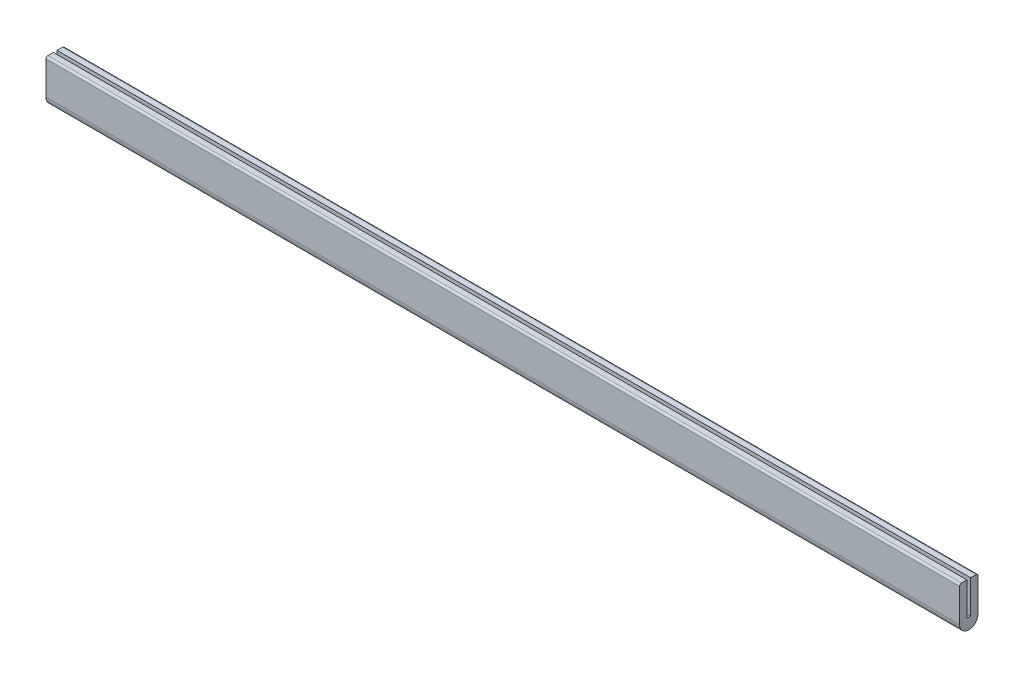
ISO-10303-21;
HEADER;
FILE_DESCRIPTION(('STEP AP214'),'2;1');
FILE_NAME('part.step','',(''),(''),'','','');
FILE_SCHEMA(('AUTOMOTIVE_DESIGN { 1 0 10303 214 1 1 1 1 }'));
ENDSEC;
DATA;
#1=APPLICATION_CONTEXT('core data for automotive mechanical design processes');
#2=APPLICATION_PROTOCOL_DEFINITION('international standard','automotive_design',2000,#1);
#3=PRODUCT_CONTEXT('',#1,'mechanical');
#4=PRODUCT('Part','Part','',(#3));
#5=PRODUCT_RELATED_PRODUCT_CATEGORY('part','',(#4));
#6=PRODUCT_DEFINITION_FORMATION('','',#4);
#7=PRODUCT_DEFINITION_CONTEXT('part definition',#1,'design');
#8=PRODUCT_DEFINITION('design','',#6,#7);
#9=PRODUCT_DEFINITION_SHAPE('','',#8);
#10=(LENGTH_UNIT() NAMED_UNIT(*) SI_UNIT(.MILLI.,.METRE.));
#11=(NAMED_UNIT(*) PLANE_ANGLE_UNIT() SI_UNIT($,.RADIAN.));
#12=(NAMED_UNIT(*) SI_UNIT($,.STERADIAN.) SOLID_ANGLE_UNIT());
#13=UNCERTAINTY_MEASURE_WITH_UNIT(LENGTH_MEASURE(1.E-05),#10,'distance_accuracy_value','');
#14=(GEOMETRIC_REPRESENTATION_CONTEXT(3) GLOBAL_UNCERTAINTY_ASSIGNED_CONTEXT((#13)) GLOBAL_UNIT_ASSIGNED_CONTEXT((#10,
#11,#12)) REPRESENTATION_CONTEXT('',''));
#15=CARTESIAN_POINT('',(0.,0.,0.));
#16=DIRECTION('',(0.,0.,1.));
#17=DIRECTION('',(1.,0.,0.));
#18=AXIS2_PLACEMENT_3D('',#15,#16,#17);
#19=CARTESIAN_POINT('',(393.7,28.575,1.5875));
#20=DIRECTION('',(0.,0.,1.));
#21=DIRECTION('',(0.,-1.,0.));
#22=AXIS2_PLACEMENT_3D('',#19,#20,#21);
#23=PLANE('',#22);
#24=DIRECTION('',(0.,1.,0.));
#25=VECTOR('',#24,1.);
#26=CARTESIAN_POINT('',(-393.7,28.575,1.5875));
#27=LINE('',#26,#25);
#28=CARTESIAN_POINT('',(-393.7,0.,1.5875));
#29=VERTEX_POINT('',#28);
#30=CARTESIAN_POINT('',(-393.7,28.575,1.5875));
#31=VERTEX_POINT('',#30);
#32=EDGE_CURVE('E161',#29,#31,#27,.T.);
#33=ORIENTED_EDGE('',*,*,#32,.T.);
#34=DIRECTION('',(-1.,0.,0.));
#35=VECTOR('',#34,1.);
#36=CARTESIAN_POINT('',(393.7,28.575,1.5875));
#37=LINE('',#36,#35);
#38=CARTESIAN_POINT('',(393.7,28.575,1.5875));
#39=VERTEX_POINT('',#38);
#40=EDGE_CURVE('E141',#39,#31,#37,.T.);
#41=ORIENTED_EDGE('',*,*,#40,.F.);
#42=DIRECTION('',(0.,1.,0.));
#43=VECTOR('',#42,1.);
#44=CARTESIAN_POINT('',(393.7,28.575,1.5875));
#45=LINE('',#44,#43);
#46=CARTESIAN_POINT('',(393.7,0.,1.5875));
#47=VERTEX_POINT('',#46);
#48=EDGE_CURVE('E148',#47,#39,#45,.T.);
#49=ORIENTED_EDGE('',*,*,#48,.F.);
#50=DIRECTION('',(-1.,0.,0.));
#51=VECTOR('',#50,1.);
#52=CARTESIAN_POINT('',(393.7,0.,1.5875));
#53=LINE('',#52,#51);
#54=EDGE_CURVE('E219',#47,#29,#53,.T.);
#55=ORIENTED_EDGE('',*,*,#54,.T.);
#56=EDGE_LOOP('',(#33,#41,#49,#55));
#57=FACE_BOUND('',#56,.T.);
#58=ADVANCED_FACE('F38',(#57),#23,.F.);
#59=CARTESIAN_POINT('',(393.7,28.575,1.5875));
#60=DIRECTION('',(0.,-1.,0.));
#61=DIRECTION('',(0.,0.,-1.));
#62=AXIS2_PLACEMENT_3D('',#59,#60,#61);
#63=PLANE('',#62);
#64=DIRECTION('',(0.,0.,1.));
#65=VECTOR('',#64,1.);
#66=CARTESIAN_POINT('',(-393.7,28.575,1.5875));
#67=LINE('',#66,#65);
#68=CARTESIAN_POINT('',(-393.7,28.575,6.34999999999999));
#69=VERTEX_POINT('',#68);
#70=EDGE_CURVE('E237',#31,#69,#67,.T.);
#71=ORIENTED_EDGE('',*,*,#70,.T.);
#72=DIRECTION('',(-1.,0.,0.));
#73=VECTOR('',#72,1.);
#74=CARTESIAN_POINT('',(393.7,28.575,6.34999999999999));
#75=LINE('',#74,#73);
#76=CARTESIAN_POINT('',(393.7,28.575,6.34999999999999));
#77=VERTEX_POINT('',#76);
#78=EDGE_CURVE('E144',#69,#77,#75,.F.);
#79=ORIENTED_EDGE('',*,*,#78,.T.);
#80=DIRECTION('',(0.,0.,1.));
#81=VECTOR('',#80,1.);
#82=CARTESIAN_POINT('',(393.7,28.575,1.5875));
#83=LINE('',#82,#81);
#84=EDGE_CURVE('E136',#39,#77,#83,.T.);
#85=ORIENTED_EDGE('',*,*,#84,.F.);
#86=ORIENTED_EDGE('',*,*,#40,.T.);
#87=EDGE_LOOP('',(#71,#79,#85,#86));
#88=FACE_BOUND('',#87,.T.);
#89=ADVANCED_FACE('F139',(#88),#63,.F.);
#90=CARTESIAN_POINT('',(393.7,28.575,7.93749999999999));
#91=DIRECTION('',(0.,0.,-1.));
#92=DIRECTION('',(0.,1.,0.));
#93=AXIS2_PLACEMENT_3D('',#90,#91,#92);
#94=PLANE('',#93);
#95=DIRECTION('',(0.,-1.,0.));
#96=VECTOR('',#95,1.);
#97=CARTESIAN_POINT('',(393.7,28.575,7.93749999999999));
#98=LINE('',#97,#96);
#99=CARTESIAN_POINT('',(393.7,26.9875,7.93749999999999));
#100=VERTEX_POINT('',#99);
#101=CARTESIAN_POINT('',(393.7,-1.58750000000001,7.9375));
#102=VERTEX_POINT('',#101);
#103=EDGE_CURVE('E147',#100,#102,#98,.T.);
#104=ORIENTED_EDGE('',*,*,#103,.F.);
#105=DIRECTION('',(-1.,0.,0.));
#106=VECTOR('',#105,1.);
#107=CARTESIAN_POINT('',(393.7,26.9875,7.93749999999999));
#108=LINE('',#107,#106);
#109=CARTESIAN_POINT('',(-393.7,26.9875,7.93749999999999));
#110=VERTEX_POINT('',#109);
#111=EDGE_CURVE('E163',#100,#110,#108,.T.);
#112=ORIENTED_EDGE('',*,*,#111,.T.);
#113=DIRECTION('',(0.,-1.,0.));
#114=VECTOR('',#113,1.);
#115=CARTESIAN_POINT('',(-393.7,28.575,7.93749999999999));
#116=LINE('',#115,#114);
#117=CARTESIAN_POINT('',(-393.7,-1.58750000000001,7.9375));
#118=VERTEX_POINT('',#117);
#119=EDGE_CURVE('E235',#110,#118,#116,.T.);
#120=ORIENTED_EDGE('',*,*,#119,.T.);
#121=DIRECTION('',(-1.,0.,0.));
#122=VECTOR('',#121,1.);
#123=CARTESIAN_POINT('',(393.7,-1.58750000000001,7.9375));
#124=LINE('',#123,#122);
#125=EDGE_CURVE('E164',#102,#118,#124,.T.);
#126=ORIENTED_EDGE('',*,*,#125,.F.);
#127=EDGE_LOOP('',(#104,#112,#120,#126));
#128=FACE_BOUND('',#127,.T.);
#129=ADVANCED_FACE('F261',(#128),#94,.F.);
#130=CARTESIAN_POINT('',(393.7,-1.58750000000001,0.));
#131=DIRECTION('',(-1.,0.,0.));
#132=DIRECTION('',(0.,0.,1.));
#133=AXIS2_PLACEMENT_3D('',#130,#131,#132);
#134=CYLINDRICAL_SURFACE('',#133,7.9375);
#135=CARTESIAN_POINT('',(-393.7,-1.58750000000001,0.));
#136=DIRECTION('',(1.,0.,0.));
#137=DIRECTION('',(0.,0.,1.));
#138=AXIS2_PLACEMENT_3D('',#135,#136,#137);
#139=CIRCLE('',#138,7.9375);
#140=CARTESIAN_POINT('',(-393.7,-1.5875,-7.9375));
#141=VERTEX_POINT('',#140);
#142=EDGE_CURVE('E213',#118,#141,#139,.T.);
#143=ORIENTED_EDGE('',*,*,#142,.T.);
#144=DIRECTION('',(-1.,0.,0.));
#145=VECTOR('',#144,1.);
#146=CARTESIAN_POINT('',(393.7,-1.5875,-7.9375));
#147=LINE('',#146,#145);
#148=CARTESIAN_POINT('',(393.7,-1.5875,-7.9375));
#149=VERTEX_POINT('',#148);
#150=EDGE_CURVE('E174',#149,#141,#147,.T.);
#151=ORIENTED_EDGE('',*,*,#150,.F.);
#152=CARTESIAN_POINT('',(393.7,-1.58750000000001,0.));
#153=DIRECTION('',(1.,0.,0.));
#154=DIRECTION('',(0.,0.,1.));
#155=AXIS2_PLACEMENT_3D('',#152,#153,#154);
#156=CIRCLE('',#155,7.9375);
#157=EDGE_CURVE('E253',#102,#149,#156,.T.);
#158=ORIENTED_EDGE('',*,*,#157,.F.);
#159=ORIENTED_EDGE('',*,*,#125,.T.);
#160=EDGE_LOOP('',(#143,#151,#158,#159));
#161=FACE_BOUND('',#160,.T.);
#162=ADVANCED_FACE('F262',(#161),#134,.T.);
#163=CARTESIAN_POINT('',(393.7,28.575,-7.93749999999999));
#164=DIRECTION('',(0.,0.,1.));
#165=DIRECTION('',(0.,-1.,0.));
#166=AXIS2_PLACEMENT_3D('',#163,#164,#165);
#167=PLANE('',#166);
#168=DIRECTION('',(0.,1.,0.));
#169=VECTOR('',#168,1.);
#170=CARTESIAN_POINT('',(-393.7,28.575,-7.93749999999999));
#171=LINE('',#170,#169);
#172=CARTESIAN_POINT('',(-393.7,26.9875,-7.93749999999999));
#173=VERTEX_POINT('',#172);
#174=EDGE_CURVE('E208',#141,#173,#171,.T.);
#175=ORIENTED_EDGE('',*,*,#174,.T.);
#176=DIRECTION('',(-1.,0.,0.));
#177=VECTOR('',#176,1.);
#178=CARTESIAN_POINT('',(393.7,26.9875,-7.93749999999999));
#179=LINE('',#178,#177);
#180=CARTESIAN_POINT('',(393.7,26.9875,-7.93749999999999));
#181=VERTEX_POINT('',#180);
#182=EDGE_CURVE('E11',#173,#181,#179,.F.);
#183=ORIENTED_EDGE('',*,*,#182,.T.);
#184=DIRECTION('',(0.,1.,0.));
#185=VECTOR('',#184,1.);
#186=CARTESIAN_POINT('',(393.7,28.575,-7.93749999999999));
#187=LINE('',#186,#185);
#188=EDGE_CURVE('E231',#149,#181,#187,.T.);
#189=ORIENTED_EDGE('',*,*,#188,.F.);
#190=ORIENTED_EDGE('',*,*,#150,.T.);
#191=EDGE_LOOP('',(#175,#183,#189,#190));
#192=FACE_BOUND('',#191,.T.);
#193=ADVANCED_FACE('F230',(#192),#167,.F.);
#194=CARTESIAN_POINT('',(393.7,28.575,-7.93749999999999));
#195=DIRECTION('',(0.,-1.,0.));
#196=DIRECTION('',(0.,0.,-1.));
#197=AXIS2_PLACEMENT_3D('',#194,#195,#196);
#198=PLANE('',#197);
#199=DIRECTION('',(0.,0.,1.));
#200=VECTOR('',#199,1.);
#201=CARTESIAN_POINT('',(393.7,28.575,-7.93749999999999));
#202=LINE('',#201,#200);
#203=CARTESIAN_POINT('',(393.7,28.575,-6.34999999999999));
#204=VERTEX_POINT('',#203);
#205=CARTESIAN_POINT('',(393.7,28.575,-1.58749999999999));
#206=VERTEX_POINT('',#205);
#207=EDGE_CURVE('E198',#204,#206,#202,.T.);
#208=ORIENTED_EDGE('',*,*,#207,.F.);
#209=DIRECTION('',(-1.,0.,0.));
#210=VECTOR('',#209,1.);
#211=CARTESIAN_POINT('',(393.7,28.575,-6.34999999999999));
#212=LINE('',#211,#210);
#213=CARTESIAN_POINT('',(-393.7,28.575,-6.34999999999999));
#214=VERTEX_POINT('',#213);
#215=EDGE_CURVE('E47',#204,#214,#212,.T.);
#216=ORIENTED_EDGE('',*,*,#215,.T.);
#217=DIRECTION('',(0.,0.,1.));
#218=VECTOR('',#217,1.);
#219=CARTESIAN_POINT('',(-393.7,28.575,-7.93749999999999));
#220=LINE('',#219,#218);
#221=CARTESIAN_POINT('',(-393.7,28.575,-1.58749999999999));
#222=VERTEX_POINT('',#221);
#223=EDGE_CURVE('E196',#214,#222,#220,.T.);
#224=ORIENTED_EDGE('',*,*,#223,.T.);
#225=DIRECTION('',(-1.,0.,0.));
#226=VECTOR('',#225,1.);
#227=CARTESIAN_POINT('',(393.7,28.575,-1.58749999999999));
#228=LINE('',#227,#226);
#229=EDGE_CURVE('E226',#206,#222,#228,.T.);
#230=ORIENTED_EDGE('',*,*,#229,.F.);
#231=EDGE_LOOP('',(#208,#216,#224,#230));
#232=FACE_BOUND('',#231,.T.);
#233=ADVANCED_FACE('F194',(#232),#198,.F.);
#234=CARTESIAN_POINT('',(393.7,28.575,-1.58749999999999));
#235=DIRECTION('',(0.,0.,-1.));
#236=DIRECTION('',(0.,1.,0.));
#237=AXIS2_PLACEMENT_3D('',#234,#235,#236);
#238=PLANE('',#237);
#239=DIRECTION('',(0.,-1.,0.));
#240=VECTOR('',#239,1.);
#241=CARTESIAN_POINT('',(-393.7,28.575,-1.58749999999999));
#242=LINE('',#241,#240);
#243=CARTESIAN_POINT('',(-393.7,0.,-1.5875));
#244=VERTEX_POINT('',#243);
#245=EDGE_CURVE('E206',#222,#244,#242,.T.);
#246=ORIENTED_EDGE('',*,*,#245,.T.);
#247=DIRECTION('',(-1.,0.,0.));
#248=VECTOR('',#247,1.);
#249=CARTESIAN_POINT('',(393.7,0.,-1.5875));
#250=LINE('',#249,#248);
#251=CARTESIAN_POINT('',(393.7,0.,-1.5875));
#252=VERTEX_POINT('',#251);
#253=EDGE_CURVE('E222',#252,#244,#250,.T.);
#254=ORIENTED_EDGE('',*,*,#253,.F.);
#255=DIRECTION('',(0.,-1.,0.));
#256=VECTOR('',#255,1.);
#257=CARTESIAN_POINT('',(393.7,28.575,-1.58749999999999));
#258=LINE('',#257,#256);
#259=EDGE_CURVE('E246',#206,#252,#258,.T.);
#260=ORIENTED_EDGE('',*,*,#259,.F.);
#261=ORIENTED_EDGE('',*,*,#229,.T.);
#262=EDGE_LOOP('',(#246,#254,#260,#261));
#263=FACE_BOUND('',#262,.T.);
#264=ADVANCED_FACE('F290',(#263),#238,.F.);
#265=CARTESIAN_POINT('',(393.7,0.,1.5875));
#266=DIRECTION('',(0.,-1.,0.));
#267=DIRECTION('',(0.,0.,-1.));
#268=AXIS2_PLACEMENT_3D('',#265,#266,#267);
#269=PLANE('',#268);
#270=DIRECTION('',(0.,0.,1.));
#271=VECTOR('',#270,1.);
#272=CARTESIAN_POINT('',(-393.7,0.,1.5875));
#273=LINE('',#272,#271);
#274=EDGE_CURVE('E158',#244,#29,#273,.T.);
#275=ORIENTED_EDGE('',*,*,#274,.T.);
#276=ORIENTED_EDGE('',*,*,#54,.F.);
#277=DIRECTION('',(0.,0.,1.));
#278=VECTOR('',#277,1.);
#279=CARTESIAN_POINT('',(393.7,0.,1.5875));
#280=LINE('',#279,#278);
#281=EDGE_CURVE('E153',#252,#47,#280,.T.);
#282=ORIENTED_EDGE('',*,*,#281,.F.);
#283=ORIENTED_EDGE('',*,*,#253,.T.);
#284=EDGE_LOOP('',(#275,#276,#282,#283));
#285=FACE_BOUND('',#284,.T.);
#286=ADVANCED_FACE('F286',(#285),#269,.F.);
#287=CARTESIAN_POINT('',(393.7,-1.58750000000001,0.));
#288=DIRECTION('',(-1.,0.,0.));
#289=DIRECTION('',(0.,0.,1.));
#290=AXIS2_PLACEMENT_3D('',#287,#288,#289);
#291=PLANE('',#290);
#292=ORIENTED_EDGE('',*,*,#84,.T.);
#293=CARTESIAN_POINT('',(393.7,26.9875,6.34999999999999));
#294=DIRECTION('',(-1.,0.,0.));
#295=DIRECTION('',(0.,0.,1.));
#296=AXIS2_PLACEMENT_3D('',#293,#294,#295);
#297=CIRCLE('',#296,1.5875);
#298=EDGE_CURVE('E186',#77,#100,#297,.F.);
#299=ORIENTED_EDGE('',*,*,#298,.T.);
#300=ORIENTED_EDGE('',*,*,#103,.T.);
#301=ORIENTED_EDGE('',*,*,#157,.T.);
#302=ORIENTED_EDGE('',*,*,#188,.T.);
#303=CARTESIAN_POINT('',(393.7,26.9875,-6.34999999999999));
#304=DIRECTION('',(-1.,0.,0.));
#305=DIRECTION('',(0.,0.,1.));
#306=AXIS2_PLACEMENT_3D('',#303,#304,#305);
#307=CIRCLE('',#306,1.5875);
#308=EDGE_CURVE('E57',#181,#204,#307,.F.);
#309=ORIENTED_EDGE('',*,*,#308,.T.);
#310=ORIENTED_EDGE('',*,*,#207,.T.);
#311=ORIENTED_EDGE('',*,*,#259,.T.);
#312=ORIENTED_EDGE('',*,*,#281,.T.);
#313=ORIENTED_EDGE('',*,*,#48,.T.);
#314=EDGE_LOOP('',(#292,#299,#300,#301,#302,#309,#310,#311,#312,#313));
#315=FACE_BOUND('',#314,.T.);
#316=ADVANCED_FACE('F151',(#315),#291,.F.);
#317=CARTESIAN_POINT('',(-393.7,-1.58750000000001,0.));
#318=DIRECTION('',(-1.,0.,0.));
#319=DIRECTION('',(0.,0.,1.));
#320=AXIS2_PLACEMENT_3D('',#317,#318,#319);
#321=PLANE('',#320);
#322=ORIENTED_EDGE('',*,*,#119,.F.);
#323=CARTESIAN_POINT('',(-393.7,26.9875,6.34999999999999));
#324=DIRECTION('',(-1.,0.,0.));
#325=DIRECTION('',(0.,0.,1.));
#326=AXIS2_PLACEMENT_3D('',#323,#324,#325);
#327=CIRCLE('',#326,1.5875);
#328=EDGE_CURVE('E180',#110,#69,#327,.T.);
#329=ORIENTED_EDGE('',*,*,#328,.T.);
#330=ORIENTED_EDGE('',*,*,#70,.F.);
#331=ORIENTED_EDGE('',*,*,#32,.F.);
#332=ORIENTED_EDGE('',*,*,#274,.F.);
#333=ORIENTED_EDGE('',*,*,#245,.F.);
#334=ORIENTED_EDGE('',*,*,#223,.F.);
#335=CARTESIAN_POINT('',(-393.7,26.9875,-6.34999999999999));
#336=DIRECTION('',(-1.,0.,0.));
#337=DIRECTION('',(0.,0.,1.));
#338=AXIS2_PLACEMENT_3D('',#335,#336,#337);
#339=CIRCLE('',#338,1.5875);
#340=EDGE_CURVE('E170',#214,#173,#339,.T.);
#341=ORIENTED_EDGE('',*,*,#340,.T.);
#342=ORIENTED_EDGE('',*,*,#174,.F.);
#343=ORIENTED_EDGE('',*,*,#142,.F.);
#344=EDGE_LOOP('',(#322,#329,#330,#331,#332,#333,#334,#341,#342,#343));
#345=FACE_BOUND('',#344,.T.);
#346=ADVANCED_FACE('F203',(#345),#321,.T.);
#347=CARTESIAN_POINT('',(393.7,26.9875,6.34999999999999));
#348=DIRECTION('',(-1.,0.,0.));
#349=DIRECTION('',(0.,0.,1.));
#350=AXIS2_PLACEMENT_3D('',#347,#348,#349);
#351=CYLINDRICAL_SURFACE('',#350,1.5875);
#352=ORIENTED_EDGE('',*,*,#298,.F.);
#353=ORIENTED_EDGE('',*,*,#78,.F.);
#354=ORIENTED_EDGE('',*,*,#328,.F.);
#355=ORIENTED_EDGE('',*,*,#111,.F.);
#356=EDGE_LOOP('',(#352,#353,#354,#355));
#357=FACE_BOUND('',#356,.T.);
#358=ADVANCED_FACE('F277',(#357),#351,.T.);
#359=CARTESIAN_POINT('',(393.7,26.9875,-6.34999999999999));
#360=DIRECTION('',(-1.,0.,0.));
#361=DIRECTION('',(0.,0.,1.));
#362=AXIS2_PLACEMENT_3D('',#359,#360,#361);
#363=CYLINDRICAL_SURFACE('',#362,1.5875);
#364=ORIENTED_EDGE('',*,*,#308,.F.);
#365=ORIENTED_EDGE('',*,*,#182,.F.);
#366=ORIENTED_EDGE('',*,*,#340,.F.);
#367=ORIENTED_EDGE('',*,*,#215,.F.);
#368=EDGE_LOOP('',(#364,#365,#366,#367));
#369=FACE_BOUND('',#368,.T.);
#370=ADVANCED_FACE('F40',(#369),#363,.T.);
#371=CLOSED_SHELL('',(#58,#89,#129,#162,#193,#233,#264,#286,#316,#346,#358,#370));
#372=MANIFOLD_SOLID_BREP('B2',#371);
#373=ADVANCED_BREP_SHAPE_REPRESENTATION('',(#18,#372),#14);
#374=SHAPE_DEFINITION_REPRESENTATION(#9,#373);
ENDSEC;
END-ISO-10303-21;
